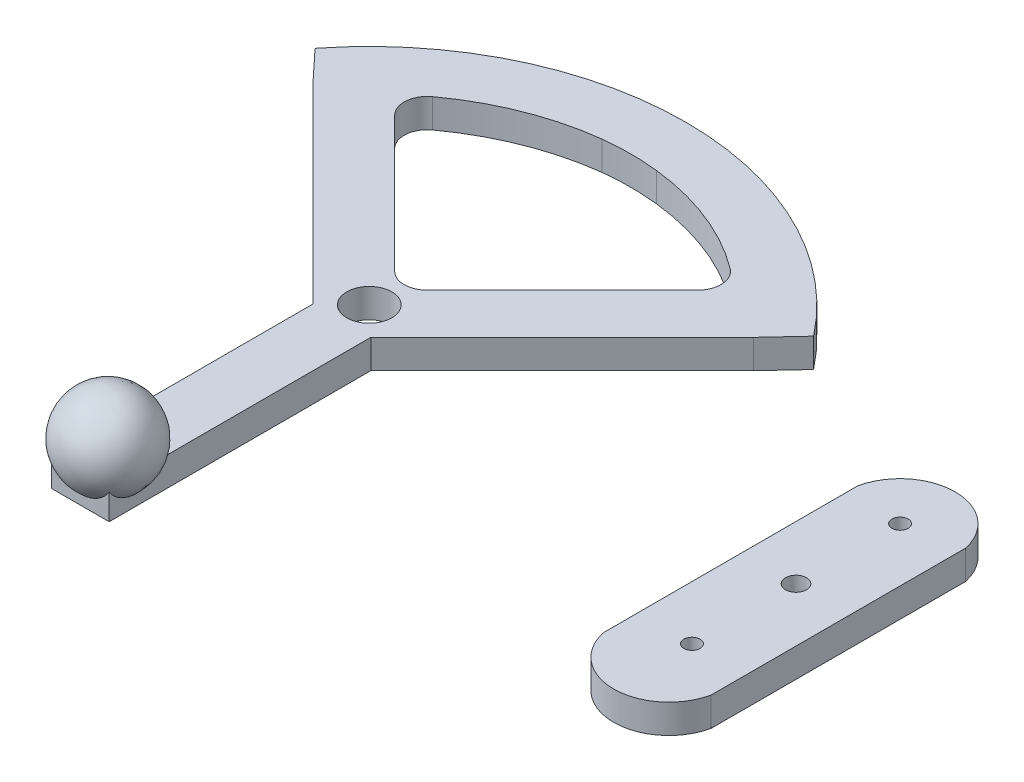
ISO-10303-21;
HEADER;
FILE_DESCRIPTION(('STEP AP214'),'2;1');
FILE_NAME('part.step','',(''),(''),'','','');
FILE_SCHEMA(('AUTOMOTIVE_DESIGN { 1 0 10303 214 1 1 1 1 }'));
ENDSEC;
DATA;
#1=APPLICATION_CONTEXT('core data for automotive mechanical design processes');
#2=APPLICATION_PROTOCOL_DEFINITION('international standard','automotive_design',2000,#1);
#3=PRODUCT_CONTEXT('',#1,'mechanical');
#4=PRODUCT('Part','Part','',(#3));
#5=PRODUCT_RELATED_PRODUCT_CATEGORY('part','',(#4));
#6=PRODUCT_DEFINITION_FORMATION('','',#4);
#7=PRODUCT_DEFINITION_CONTEXT('part definition',#1,'design');
#8=PRODUCT_DEFINITION('design','',#6,#7);
#9=PRODUCT_DEFINITION_SHAPE('','',#8);
#10=(LENGTH_UNIT() NAMED_UNIT(*) SI_UNIT(.MILLI.,.METRE.));
#11=(NAMED_UNIT(*) PLANE_ANGLE_UNIT() SI_UNIT($,.RADIAN.));
#12=(NAMED_UNIT(*) SI_UNIT($,.STERADIAN.) SOLID_ANGLE_UNIT());
#13=UNCERTAINTY_MEASURE_WITH_UNIT(LENGTH_MEASURE(1.E-05),#10,'distance_accuracy_value','');
#14=(GEOMETRIC_REPRESENTATION_CONTEXT(3) GLOBAL_UNCERTAINTY_ASSIGNED_CONTEXT((#13)) GLOBAL_UNIT_ASSIGNED_CONTEXT((#10,
#11,#12)) REPRESENTATION_CONTEXT('',''));
#15=CARTESIAN_POINT('',(0.,0.,0.));
#16=DIRECTION('',(0.,0.,1.));
#17=DIRECTION('',(1.,0.,0.));
#18=AXIS2_PLACEMENT_3D('',#15,#16,#17);
#19=CARTESIAN_POINT('',(99.9381169188753,12.6954113524003,34.1249884138105));
#20=DIRECTION('',(0.,-1.,0.));
#21=DIRECTION('',(0.,0.,1.));
#22=AXIS2_PLACEMENT_3D('',#19,#20,#21);
#23=PLANE('',#22);
#24=CARTESIAN_POINT('',(99.9381169188752,12.6954113524003,-16.6750115861895));
#25=DIRECTION('',(0.,1.,0.));
#26=DIRECTION('',(0.,0.,-1.));
#27=AXIS2_PLACEMENT_3D('',#24,#25,#26);
#28=CIRCLE('',#27,1.77800000000001);
#29=CARTESIAN_POINT('',(99.9381169188752,12.6954113524003,-18.4530115861895));
#30=VERTEX_POINT('',#29);
#31=EDGE_CURVE('E151',#30,#30,#28,.T.);
#32=ORIENTED_EDGE('',*,*,#31,.F.);
#33=EDGE_LOOP('',(#32));
#34=FACE_BOUND('',#33,.T.);
#35=DIRECTION('',(0.,0.,-1.));
#36=VECTOR('',#35,1.);
#37=CARTESIAN_POINT('',(111.787378232907,12.6954113524002,31.5849884138105));
#38=LINE('',#37,#36);
#39=CARTESIAN_POINT('',(111.787378232907,12.6954113524002,36.6649884138105));
#40=VERTEX_POINT('',#39);
#41=CARTESIAN_POINT('',(111.787378232906,12.6954113524002,-19.2150115861895));
#42=VERTEX_POINT('',#41);
#43=EDGE_CURVE('E102',#40,#42,#38,.T.);
#44=ORIENTED_EDGE('',*,*,#43,.T.);
#45=CARTESIAN_POINT('',(99.9381169188752,12.6954113524003,-16.6750115861895));
#46=DIRECTION('',(0.,1.,0.));
#47=DIRECTION('',(0.,0.,-1.));
#48=AXIS2_PLACEMENT_3D('',#45,#46,#47);
#49=CIRCLE('',#48,12.1184402333054);
#50=CARTESIAN_POINT('',(88.088855604844,12.6954113524005,-19.2150115861894));
#51=VERTEX_POINT('',#50);
#52=EDGE_CURVE('E105',#42,#51,#49,.T.);
#53=ORIENTED_EDGE('',*,*,#52,.T.);
#54=DIRECTION('',(0.,0.,1.));
#55=VECTOR('',#54,1.);
#56=CARTESIAN_POINT('',(88.0888556048439,12.6954113524005,-19.2150115861894));
#57=LINE('',#56,#55);
#58=CARTESIAN_POINT('',(88.0888556048442,12.6954113524005,36.6649884138106));
#59=VERTEX_POINT('',#58);
#60=EDGE_CURVE('E109',#51,#59,#57,.T.);
#61=ORIENTED_EDGE('',*,*,#60,.T.);
#62=CARTESIAN_POINT('',(99.9381169188753,12.6954113524003,34.1249884138105));
#63=DIRECTION('',(0.,1.,0.));
#64=DIRECTION('',(0.,0.,1.));
#65=AXIS2_PLACEMENT_3D('',#62,#63,#64);
#66=CIRCLE('',#65,12.1184402333055);
#67=EDGE_CURVE('E74',#59,#40,#66,.T.);
#68=ORIENTED_EDGE('',*,*,#67,.T.);
#69=EDGE_LOOP('',(#44,#53,#61,#68));
#70=FACE_BOUND('',#69,.T.);
#71=CARTESIAN_POINT('',(99.9381169188753,12.6954113524003,6.18498841381052));
#72=DIRECTION('',(0.,1.,0.));
#73=DIRECTION('',(0.,0.,-1.));
#74=AXIS2_PLACEMENT_3D('',#71,#72,#73);
#75=CIRCLE('',#74,2.305);
#76=CARTESIAN_POINT('',(99.9381169188752,12.6954113524003,3.87998841381051));
#77=VERTEX_POINT('',#76);
#78=EDGE_CURVE('E123',#77,#77,#75,.T.);
#79=ORIENTED_EDGE('',*,*,#78,.F.);
#80=EDGE_LOOP('',(#79));
#81=FACE_BOUND('',#80,.T.);
#82=CARTESIAN_POINT('',(99.9381169188753,12.6954113524003,29.0449884138106));
#83=DIRECTION('',(0.,1.,0.));
#84=DIRECTION('',(0.,0.,-1.));
#85=AXIS2_PLACEMENT_3D('',#82,#83,#84);
#86=CIRCLE('',#85,1.778);
#87=CARTESIAN_POINT('',(99.9381169188753,12.6954113524003,27.2669884138105));
#88=VERTEX_POINT('',#87);
#89=EDGE_CURVE('E145',#88,#88,#86,.T.);
#90=ORIENTED_EDGE('',*,*,#89,.F.);
#91=EDGE_LOOP('',(#90));
#92=FACE_BOUND('',#91,.T.);
#93=ADVANCED_FACE('F57',(#34,#70,#81,#92),#23,.F.);
#94=CARTESIAN_POINT('',(99.9381169188753,6.34541135240033,34.1249884138105));
#95=DIRECTION('',(0.,-1.,0.));
#96=DIRECTION('',(0.,0.,1.));
#97=AXIS2_PLACEMENT_3D('',#94,#95,#96);
#98=PLANE('',#97);
#99=CARTESIAN_POINT('',(99.9381169188751,6.34541135240033,-16.6750115861895));
#100=DIRECTION('',(0.,1.,0.));
#101=DIRECTION('',(0.,0.,-1.));
#102=AXIS2_PLACEMENT_3D('',#99,#100,#101);
#103=CIRCLE('',#102,1.77800000000001);
#104=CARTESIAN_POINT('',(99.9381169188751,6.34541135240033,-18.4530115861895));
#105=VERTEX_POINT('',#104);
#106=EDGE_CURVE('E148',#105,#105,#103,.T.);
#107=ORIENTED_EDGE('',*,*,#106,.T.);
#108=EDGE_LOOP('',(#107));
#109=FACE_BOUND('',#108,.T.);
#110=DIRECTION('',(0.,0.,-1.));
#111=VECTOR('',#110,1.);
#112=CARTESIAN_POINT('',(111.787378232906,6.34541135240021,31.5849884138105));
#113=LINE('',#112,#111);
#114=CARTESIAN_POINT('',(111.787378232906,6.34541135240021,36.6649884138105));
#115=VERTEX_POINT('',#114);
#116=CARTESIAN_POINT('',(111.787378232906,6.34541135240021,-19.2150115861895));
#117=VERTEX_POINT('',#116);
#118=EDGE_CURVE('E97',#115,#117,#113,.T.);
#119=ORIENTED_EDGE('',*,*,#118,.F.);
#120=CARTESIAN_POINT('',(99.9381169188753,6.34541135240033,34.1249884138105));
#121=DIRECTION('',(0.,1.,0.));
#122=DIRECTION('',(0.,0.,1.));
#123=AXIS2_PLACEMENT_3D('',#120,#121,#122);
#124=CIRCLE('',#123,12.1184402333055);
#125=CARTESIAN_POINT('',(88.0888556048441,6.34541135240045,36.6649884138106));
#126=VERTEX_POINT('',#125);
#127=EDGE_CURVE('E126',#126,#115,#124,.T.);
#128=ORIENTED_EDGE('',*,*,#127,.F.);
#129=DIRECTION('',(0.,0.,1.));
#130=VECTOR('',#129,1.);
#131=CARTESIAN_POINT('',(88.0888556048441,6.34541135240045,31.5849884138106));
#132=LINE('',#131,#130);
#133=CARTESIAN_POINT('',(88.0888556048439,6.34541135240045,-19.2150115861894));
#134=VERTEX_POINT('',#133);
#135=EDGE_CURVE('E90',#134,#126,#132,.T.);
#136=ORIENTED_EDGE('',*,*,#135,.F.);
#137=CARTESIAN_POINT('',(99.9381169188751,6.34541135240033,-16.6750115861895));
#138=DIRECTION('',(0.,1.,0.));
#139=DIRECTION('',(0.,0.,-1.));
#140=AXIS2_PLACEMENT_3D('',#137,#138,#139);
#141=CIRCLE('',#140,12.1184402333054);
#142=EDGE_CURVE('E114',#117,#134,#141,.T.);
#143=ORIENTED_EDGE('',*,*,#142,.F.);
#144=EDGE_LOOP('',(#119,#128,#136,#143));
#145=FACE_BOUND('',#144,.T.);
#146=CARTESIAN_POINT('',(99.9381169188752,6.34541135240033,6.18498841381052));
#147=DIRECTION('',(0.,1.,0.));
#148=DIRECTION('',(0.,0.,-1.));
#149=AXIS2_PLACEMENT_3D('',#146,#147,#148);
#150=CIRCLE('',#149,2.305);
#151=CARTESIAN_POINT('',(99.9381169188752,6.34541135240033,3.87998841381051));
#152=VERTEX_POINT('',#151);
#153=EDGE_CURVE('E140',#152,#152,#150,.T.);
#154=ORIENTED_EDGE('',*,*,#153,.T.);
#155=EDGE_LOOP('',(#154));
#156=FACE_BOUND('',#155,.T.);
#157=CARTESIAN_POINT('',(99.9381169188753,6.34541135240033,29.0449884138106));
#158=DIRECTION('',(0.,1.,0.));
#159=DIRECTION('',(0.,0.,-1.));
#160=AXIS2_PLACEMENT_3D('',#157,#158,#159);
#161=CIRCLE('',#160,1.778);
#162=CARTESIAN_POINT('',(99.9381169188753,6.34541135240033,27.2669884138105));
#163=VERTEX_POINT('',#162);
#164=EDGE_CURVE('E143',#163,#163,#161,.T.);
#165=ORIENTED_EDGE('',*,*,#164,.T.);
#166=EDGE_LOOP('',(#165));
#167=FACE_BOUND('',#166,.T.);
#168=ADVANCED_FACE('F132',(#109,#145,#156,#167),#98,.T.);
#169=CARTESIAN_POINT('',(111.787378232907,12.6954113524002,31.5849884138105));
#170=DIRECTION('',(-1.,0.,0.));
#171=DIRECTION('',(0.,0.,1.));
#172=AXIS2_PLACEMENT_3D('',#169,#170,#171);
#173=PLANE('',#172);
#174=ORIENTED_EDGE('',*,*,#118,.T.);
#175=DIRECTION('',(0.,-1.,0.));
#176=VECTOR('',#175,1.);
#177=CARTESIAN_POINT('',(111.787378232906,12.6954113524002,-19.2150115861895));
#178=LINE('',#177,#176);
#179=EDGE_CURVE('E13',#42,#117,#178,.T.);
#180=ORIENTED_EDGE('',*,*,#179,.F.);
#181=ORIENTED_EDGE('',*,*,#43,.F.);
#182=DIRECTION('',(0.,-1.,0.));
#183=VECTOR('',#182,1.);
#184=CARTESIAN_POINT('',(111.787378232907,12.6954113524002,36.6649884138105));
#185=LINE('',#184,#183);
#186=EDGE_CURVE('E118',#40,#115,#185,.T.);
#187=ORIENTED_EDGE('',*,*,#186,.T.);
#188=EDGE_LOOP('',(#174,#180,#181,#187));
#189=FACE_BOUND('',#188,.T.);
#190=ADVANCED_FACE('F59',(#189),#173,.F.);
#191=CARTESIAN_POINT('',(99.9381169188752,12.6954113524003,-16.6750115861895));
#192=DIRECTION('',(0.,-1.,0.));
#193=DIRECTION('',(0.,0.,1.));
#194=AXIS2_PLACEMENT_3D('',#191,#192,#193);
#195=CYLINDRICAL_SURFACE('',#194,12.1184402333054);
#196=ORIENTED_EDGE('',*,*,#142,.T.);
#197=DIRECTION('',(0.,-1.,0.));
#198=VECTOR('',#197,1.);
#199=CARTESIAN_POINT('',(88.088855604844,12.6954113524005,-19.2150115861894));
#200=LINE('',#199,#198);
#201=EDGE_CURVE('E66',#51,#134,#200,.T.);
#202=ORIENTED_EDGE('',*,*,#201,.F.);
#203=ORIENTED_EDGE('',*,*,#52,.F.);
#204=ORIENTED_EDGE('',*,*,#179,.T.);
#205=EDGE_LOOP('',(#196,#202,#203,#204));
#206=FACE_BOUND('',#205,.T.);
#207=ADVANCED_FACE('F113',(#206),#195,.T.);
#208=CARTESIAN_POINT('',(88.0888556048442,12.6954113524005,31.5849884138106));
#209=DIRECTION('',(1.,0.,0.));
#210=DIRECTION('',(0.,0.,-1.));
#211=AXIS2_PLACEMENT_3D('',#208,#209,#210);
#212=PLANE('',#211);
#213=ORIENTED_EDGE('',*,*,#135,.T.);
#214=DIRECTION('',(0.,-1.,0.));
#215=VECTOR('',#214,1.);
#216=CARTESIAN_POINT('',(88.0888556048442,12.6954113524005,36.6649884138106));
#217=LINE('',#216,#215);
#218=EDGE_CURVE('E115',#59,#126,#217,.T.);
#219=ORIENTED_EDGE('',*,*,#218,.F.);
#220=ORIENTED_EDGE('',*,*,#60,.F.);
#221=ORIENTED_EDGE('',*,*,#201,.T.);
#222=EDGE_LOOP('',(#213,#219,#220,#221));
#223=FACE_BOUND('',#222,.T.);
#224=ADVANCED_FACE('F116',(#223),#212,.F.);
#225=CARTESIAN_POINT('',(99.9381169188753,12.6954113524003,34.1249884138105));
#226=DIRECTION('',(0.,-1.,0.));
#227=DIRECTION('',(0.,0.,1.));
#228=AXIS2_PLACEMENT_3D('',#225,#226,#227);
#229=CYLINDRICAL_SURFACE('',#228,12.1184402333055);
#230=ORIENTED_EDGE('',*,*,#127,.T.);
#231=ORIENTED_EDGE('',*,*,#186,.F.);
#232=ORIENTED_EDGE('',*,*,#67,.F.);
#233=ORIENTED_EDGE('',*,*,#218,.T.);
#234=EDGE_LOOP('',(#230,#231,#232,#233));
#235=FACE_BOUND('',#234,.T.);
#236=ADVANCED_FACE('F131',(#235),#229,.T.);
#237=CARTESIAN_POINT('',(99.9381169188753,12.6954113524003,6.18498841381052));
#238=DIRECTION('',(0.,-1.,0.));
#239=DIRECTION('',(0.,0.,1.));
#240=AXIS2_PLACEMENT_3D('',#237,#238,#239);
#241=CYLINDRICAL_SURFACE('',#240,2.305);
#242=ORIENTED_EDGE('',*,*,#78,.T.);
#243=EDGE_LOOP('',(#242));
#244=FACE_BOUND('',#243,.T.);
#245=ORIENTED_EDGE('',*,*,#153,.F.);
#246=EDGE_LOOP('',(#245));
#247=FACE_BOUND('',#246,.T.);
#248=ADVANCED_FACE('F160',(#244,#247),#241,.F.);
#249=CARTESIAN_POINT('',(99.9381169188752,12.6954113524003,-16.6750115861895));
#250=DIRECTION('',(0.,-1.,0.));
#251=DIRECTION('',(0.,0.,1.));
#252=AXIS2_PLACEMENT_3D('',#249,#250,#251);
#253=CYLINDRICAL_SURFACE('',#252,1.77800000000001);
#254=ORIENTED_EDGE('',*,*,#31,.T.);
#255=EDGE_LOOP('',(#254));
#256=FACE_BOUND('',#255,.T.);
#257=ORIENTED_EDGE('',*,*,#106,.F.);
#258=EDGE_LOOP('',(#257));
#259=FACE_BOUND('',#258,.T.);
#260=ADVANCED_FACE('F170',(#256,#259),#253,.F.);
#261=CARTESIAN_POINT('',(99.9381169188753,12.6954113524003,29.0449884138106));
#262=DIRECTION('',(0.,-1.,0.));
#263=DIRECTION('',(0.,0.,1.));
#264=AXIS2_PLACEMENT_3D('',#261,#262,#263);
#265=CYLINDRICAL_SURFACE('',#264,1.778);
#266=ORIENTED_EDGE('',*,*,#89,.T.);
#267=EDGE_LOOP('',(#266));
#268=FACE_BOUND('',#267,.T.);
#269=ORIENTED_EDGE('',*,*,#164,.F.);
#270=EDGE_LOOP('',(#269));
#271=FACE_BOUND('',#270,.T.);
#272=ADVANCED_FACE('F168',(#268,#271),#265,.F.);
#273=CLOSED_SHELL('',(#93,#168,#190,#207,#224,#236,#248,#260,#272));
#274=MANIFOLD_SOLID_BREP('B2',#273);
#275=CARTESIAN_POINT('',(-39.7785373265375,12.7,-45.3516658256481));
#276=DIRECTION('',(0.707106781186548,0.,-0.707106781186547));
#277=DIRECTION('',(-0.707106781186547,0.,-0.707106781186548));
#278=AXIS2_PLACEMENT_3D('',#275,#276,#277);
#279=PLANE('',#278);
#280=DIRECTION('',(0.707106781186547,0.,0.707106781186548));
#281=VECTOR('',#280,1.);
#282=CARTESIAN_POINT('',(-39.7785373265375,6.35,-45.3516658256481));
#283=LINE('',#282,#281);
#284=CARTESIAN_POINT('',(-33.2831311678834,6.35,-38.856259666994));
#285=VERTEX_POINT('',#284);
#286=CARTESIAN_POINT('',(-3.59210244842767,6.35,-9.16523094753825));
#287=VERTEX_POINT('',#286);
#288=EDGE_CURVE('E274',#285,#287,#283,.T.);
#289=ORIENTED_EDGE('',*,*,#288,.F.);
#290=DIRECTION('',(0.,-1.,0.));
#291=VECTOR('',#290,1.);
#292=CARTESIAN_POINT('',(-33.2831311678833,90.455148343755,-38.8562596669941));
#293=LINE('',#292,#291);
#294=CARTESIAN_POINT('',(-33.2831311678834,12.7,-38.856259666994));
#295=VERTEX_POINT('',#294);
#296=EDGE_CURVE('E269',#295,#285,#293,.T.);
#297=ORIENTED_EDGE('',*,*,#296,.F.);
#298=DIRECTION('',(0.707106781186547,0.,0.707106781186548));
#299=VECTOR('',#298,1.);
#300=CARTESIAN_POINT('',(-39.7785373265375,12.7,-45.3516658256481));
#301=LINE('',#300,#299);
#302=CARTESIAN_POINT('',(-3.59210244842767,12.7,-9.16523094753825));
#303=VERTEX_POINT('',#302);
#304=EDGE_CURVE('E474',#295,#303,#301,.T.);
#305=ORIENTED_EDGE('',*,*,#304,.T.);
#306=DIRECTION('',(0.,-1.,0.));
#307=VECTOR('',#306,1.);
#308=CARTESIAN_POINT('',(-3.59210244842766,0.,-9.16523094753824));
#309=LINE('',#308,#307);
#310=EDGE_CURVE('E887',#303,#287,#309,.T.);
#311=ORIENTED_EDGE('',*,*,#310,.T.);
#312=EDGE_LOOP('',(#289,#297,#305,#311));
#313=FACE_BOUND('',#312,.T.);
#314=ADVANCED_FACE('F254',(#313),#279,.T.);
#315=CARTESIAN_POINT('',(0.,12.7,0.));
#316=DIRECTION('',(0.,1.,0.));
#317=DIRECTION('',(0.,0.,1.));
#318=AXIS2_PLACEMENT_3D('',#315,#316,#317);
#319=PLANE('',#318);
#320=ORIENTED_EDGE('',*,*,#304,.F.);
#321=CARTESIAN_POINT('',(-29.6910287194557,12.7,-42.4483621154218));
#322=DIRECTION('',(0.,1.,0.));
#323=DIRECTION('',(0.,0.,1.));
#324=AXIS2_PLACEMENT_3D('',#321,#322,#323);
#325=CIRCLE('',#324,5.08);
#326=CARTESIAN_POINT('',(-32.692631835589,12.7,-46.5467494486565));
#327=VERTEX_POINT('',#326);
#328=EDGE_CURVE('E394',#327,#295,#325,.T.);
#329=ORIENTED_EDGE('',*,*,#328,.F.);
#330=CARTESIAN_POINT('',(0.887803026152101,12.7,-0.696041158092707));
#331=DIRECTION('',(0.,1.,0.));
#332=DIRECTION('',(0.,0.,1.));
#333=AXIS2_PLACEMENT_3D('',#330,#331,#332);
#334=CIRCLE('',#333,56.8325000000001);
#335=CARTESIAN_POINT('',(-5.94025595338294,12.7,-57.1168765544425));
#336=VERTEX_POINT('',#335);
#337=EDGE_CURVE('E381',#327,#336,#334,.F.);
#338=ORIENTED_EDGE('',*,*,#337,.T.);
#339=CARTESIAN_POINT('',(0.,12.7,-5.57312849911058));
#340=DIRECTION('',(0.,1.,0.));
#341=DIRECTION('',(0.,0.,1.));
#342=AXIS2_PLACEMENT_3D('',#339,#340,#341);
#343=CIRCLE('',#342,51.8849169256658);
#344=CARTESIAN_POINT('',(5.95896544452985,12.7,-57.1147169031764));
#345=VERTEX_POINT('',#344);
#346=EDGE_CURVE('E403',#336,#345,#343,.F.);
#347=ORIENTED_EDGE('',*,*,#346,.T.);
#348=CARTESIAN_POINT('',(0.,12.7,-2.81200490658602));
#349=DIRECTION('',(0.,1.,0.));
#350=DIRECTION('',(0.,0.,1.));
#351=AXIS2_PLACEMENT_3D('',#348,#349,#350);
#352=CIRCLE('',#351,54.6286902584507);
#353=CARTESIAN_POINT('',(32.7547865262767,12.7,-46.5317688466142));
#354=VERTEX_POINT('',#353);
#355=EDGE_CURVE('E398',#345,#354,#352,.F.);
#356=ORIENTED_EDGE('',*,*,#355,.T.);
#357=CARTESIAN_POINT('',(29.708872103539,12.7,-42.4662054995049));
#358=DIRECTION('',(0.,1.,0.));
#359=DIRECTION('',(0.,0.,1.));
#360=AXIS2_PLACEMENT_3D('',#357,#358,#359);
#361=CIRCLE('',#360,5.07999999999999);
#362=CARTESIAN_POINT('',(33.3009745519667,12.7,-38.8741030510773));
#363=VERTEX_POINT('',#362);
#364=EDGE_CURVE('E410',#363,#354,#361,.T.);
#365=ORIENTED_EDGE('',*,*,#364,.F.);
#366=DIRECTION('',(0.707106781186548,0.,-0.707106781186547));
#367=VECTOR('',#366,1.);
#368=CARTESIAN_POINT('',(0.,12.7,-5.57312849911058));
#369=LINE('',#368,#367);
#370=CARTESIAN_POINT('',(3.59210244842766,12.7,-9.16523094753824));
#371=VERTEX_POINT('',#370);
#372=EDGE_CURVE('E476',#371,#363,#369,.T.);
#373=ORIENTED_EDGE('',*,*,#372,.F.);
#374=CARTESIAN_POINT('',(0.,12.7,-12.7573333959659));
#375=DIRECTION('',(0.,1.,0.));
#376=DIRECTION('',(0.,0.,1.));
#377=AXIS2_PLACEMENT_3D('',#374,#375,#376);
#378=CIRCLE('',#377,5.08);
#379=EDGE_CURVE('E262',#371,#303,#378,.F.);
#380=ORIENTED_EDGE('',*,*,#379,.T.);
#381=EDGE_LOOP('',(#320,#329,#338,#347,#356,#365,#373,#380));
#382=FACE_BOUND('',#381,.T.);
#383=CARTESIAN_POINT('',(0.,12.7,0.));
#384=DIRECTION('',(0.,1.,0.));
#385=DIRECTION('',(0.,0.,1.));
#386=AXIS2_PLACEMENT_3D('',#383,#384,#385);
#387=CIRCLE('',#386,4.953);
#388=CARTESIAN_POINT('',(0.,12.7,4.953));
#389=VERTEX_POINT('',#388);
#390=EDGE_CURVE('E471',#389,#389,#387,.T.);
#391=ORIENTED_EDGE('',*,*,#390,.F.);
#392=EDGE_LOOP('',(#391));
#393=FACE_BOUND('',#392,.T.);
#394=DIRECTION('',(0.681998360062498,0.,-0.731353701619171));
#395=VECTOR('',#394,1.);
#396=CARTESIAN_POINT('',(49.4171515154173,12.7,-37.1184070236845));
#397=LINE('',#396,#395);
#398=CARTESIAN_POINT('',(48.391694320571,12.7,-36.0187388144617));
#399=VERTEX_POINT('',#398);
#400=CARTESIAN_POINT('',(54.7608316819994,12.7,-42.8488024307067));
#401=VERTEX_POINT('',#400);
#402=EDGE_CURVE('E493',#399,#401,#397,.T.);
#403=ORIENTED_EDGE('',*,*,#402,.T.);
#404=CARTESIAN_POINT('',(0.,12.7,0.));
#405=DIRECTION('',(0.,1.,0.));
#406=DIRECTION('',(0.,0.,1.));
#407=AXIS2_PLACEMENT_3D('',#404,#405,#406);
#408=CIRCLE('',#407,69.5325);
#409=CARTESIAN_POINT('',(-54.7608316819994,12.7,-42.8488024307067));
#410=VERTEX_POINT('',#409);
#411=EDGE_CURVE('E428',#401,#410,#408,.T.);
#412=ORIENTED_EDGE('',*,*,#411,.T.);
#413=DIRECTION('',(0.681998360062498,0.,0.731353701619171));
#414=VECTOR('',#413,1.);
#415=CARTESIAN_POINT('',(-56.4189854668726,12.7,-44.6269546660137));
#416=LINE('',#415,#414);
#417=CARTESIAN_POINT('',(-48.391694320571,12.7,-36.0187388144618));
#418=VERTEX_POINT('',#417);
#419=EDGE_CURVE('E494',#410,#418,#416,.T.);
#420=ORIENTED_EDGE('',*,*,#419,.T.);
#421=DIRECTION('',(-0.707106781186547,0.,-0.707106781186548));
#422=VECTOR('',#421,1.);
#423=CARTESIAN_POINT('',(-48.391694320571,12.7,-36.0187388144618));
#424=LINE('',#423,#422);
#425=CARTESIAN_POINT('',(-6.34999999999972,12.7,6.02295550610956));
#426=VERTEX_POINT('',#425);
#427=EDGE_CURVE('E481',#426,#418,#424,.T.);
#428=ORIENTED_EDGE('',*,*,#427,.F.);
#429=DIRECTION('',(0.,0.,-1.));
#430=VECTOR('',#429,1.);
#431=CARTESIAN_POINT('',(-6.34999999999971,12.7,4.87647737193525));
#432=LINE('',#431,#430);
#433=CARTESIAN_POINT('',(-6.34999999999971,12.7,50.9544231423557));
#434=VERTEX_POINT('',#433);
#435=EDGE_CURVE('E487',#434,#426,#432,.T.);
#436=ORIENTED_EDGE('',*,*,#435,.F.);
#437=CARTESIAN_POINT('',(0.,12.7,57.4301779246189));
#438=DIRECTION('',(0.,1.,0.));
#439=DIRECTION('',(0.,0.,1.));
#440=AXIS2_PLACEMENT_3D('',#437,#438,#439);
#441=CIRCLE('',#440,9.06961410424942);
#442=CARTESIAN_POINT('',(6.35000000000029,12.7,50.9544231423563));
#443=VERTEX_POINT('',#442);
#444=EDGE_CURVE('E438',#443,#434,#441,.T.);
#445=ORIENTED_EDGE('',*,*,#444,.F.);
#446=DIRECTION('',(0.,0.,1.));
#447=VECTOR('',#446,1.);
#448=CARTESIAN_POINT('',(6.35000000000029,12.7,4.87647737193525));
#449=LINE('',#448,#447);
#450=CARTESIAN_POINT('',(6.35000000000029,12.7,6.022955506109));
#451=VERTEX_POINT('',#450);
#452=EDGE_CURVE('E490',#451,#443,#449,.T.);
#453=ORIENTED_EDGE('',*,*,#452,.F.);
#454=DIRECTION('',(-0.707106781186548,0.,0.707106781186547));
#455=VECTOR('',#454,1.);
#456=CARTESIAN_POINT('',(0.,12.7,12.3729555061093));
#457=LINE('',#456,#455);
#458=EDGE_CURVE('E478',#399,#451,#457,.T.);
#459=ORIENTED_EDGE('',*,*,#458,.F.);
#460=EDGE_LOOP('',(#403,#412,#420,#428,#436,#445,#453,#459));
#461=FACE_BOUND('',#460,.T.);
#462=ADVANCED_FACE('F895',(#382,#393,#461),#319,.T.);
#463=CARTESIAN_POINT('',(48.391694320571,0.,-36.0187388144617));
#464=DIRECTION('',(0.731353701619171,0.,0.681998360062498));
#465=DIRECTION('',(0.681998360062498,0.,-0.731353701619171));
#466=AXIS2_PLACEMENT_3D('',#463,#464,#465);
#467=PLANE('',#466);
#468=DIRECTION('',(-0.681998360062498,0.,0.731353701619171));
#469=VECTOR('',#468,1.);
#470=CARTESIAN_POINT('',(48.391694320571,6.35,-36.0187388144617));
#471=LINE('',#470,#469);
#472=CARTESIAN_POINT('',(54.7608316819994,6.35,-42.8488024307067));
#473=VERTEX_POINT('',#472);
#474=CARTESIAN_POINT('',(48.391694320571,6.35,-36.0187388144617));
#475=VERTEX_POINT('',#474);
#476=EDGE_CURVE('E454',#473,#475,#471,.T.);
#477=ORIENTED_EDGE('',*,*,#476,.F.);
#478=DIRECTION('',(0.,-1.,0.));
#479=VECTOR('',#478,1.);
#480=CARTESIAN_POINT('',(54.7608316819994,25.654,-42.8488024307067));
#481=LINE('',#480,#479);
#482=EDGE_CURVE('E426',#401,#473,#481,.T.);
#483=ORIENTED_EDGE('',*,*,#482,.F.);
#484=ORIENTED_EDGE('',*,*,#402,.F.);
#485=DIRECTION('',(0.,1.,0.));
#486=VECTOR('',#485,1.);
#487=CARTESIAN_POINT('',(48.391694320571,0.,-36.0187388144617));
#488=LINE('',#487,#486);
#489=EDGE_CURVE('E498',#475,#399,#488,.T.);
#490=ORIENTED_EDGE('',*,*,#489,.F.);
#491=EDGE_LOOP('',(#477,#483,#484,#490));
#492=FACE_BOUND('',#491,.T.);
#493=ADVANCED_FACE('F905',(#492),#467,.T.);
#494=CARTESIAN_POINT('',(-57.1706898676213,0.,-45.4330589445645));
#495=DIRECTION('',(-0.731353701619171,0.,0.681998360062498));
#496=DIRECTION('',(0.681998360062498,0.,0.731353701619171));
#497=AXIS2_PLACEMENT_3D('',#494,#495,#496);
#498=PLANE('',#497);
#499=ORIENTED_EDGE('',*,*,#419,.F.);
#500=DIRECTION('',(0.,-1.,0.));
#501=VECTOR('',#500,1.);
#502=CARTESIAN_POINT('',(-54.7608316819994,25.654,-42.8488024307067));
#503=LINE('',#502,#501);
#504=CARTESIAN_POINT('',(-54.7608316819994,6.35,-42.8488024307067));
#505=VERTEX_POINT('',#504);
#506=EDGE_CURVE('E425',#410,#505,#503,.T.);
#507=ORIENTED_EDGE('',*,*,#506,.T.);
#508=DIRECTION('',(-0.681998360062498,0.,-0.731353701619171));
#509=VECTOR('',#508,1.);
#510=CARTESIAN_POINT('',(-57.1706898676213,6.35,-45.4330589445645));
#511=LINE('',#510,#509);
#512=CARTESIAN_POINT('',(-48.391694320571,6.35,-36.0187388144618));
#513=VERTEX_POINT('',#512);
#514=EDGE_CURVE('E468',#513,#505,#511,.T.);
#515=ORIENTED_EDGE('',*,*,#514,.F.);
#516=DIRECTION('',(0.,1.,0.));
#517=VECTOR('',#516,1.);
#518=CARTESIAN_POINT('',(-48.391694320571,0.,-36.0187388144618));
#519=LINE('',#518,#517);
#520=EDGE_CURVE('E609',#513,#418,#519,.T.);
#521=ORIENTED_EDGE('',*,*,#520,.T.);
#522=EDGE_LOOP('',(#499,#507,#515,#521));
#523=FACE_BOUND('',#522,.T.);
#524=ADVANCED_FACE('F925',(#523),#498,.T.);
#525=CARTESIAN_POINT('',(0.,6.35,0.));
#526=DIRECTION('',(0.,1.,0.));
#527=DIRECTION('',(0.,0.,1.));
#528=AXIS2_PLACEMENT_3D('',#525,#526,#527);
#529=PLANE('',#528);
#530=CARTESIAN_POINT('',(-29.6910287194557,6.35,-42.4483621154218));
#531=DIRECTION('',(0.,1.,0.));
#532=DIRECTION('',(0.,0.,1.));
#533=AXIS2_PLACEMENT_3D('',#530,#531,#532);
#534=CIRCLE('',#533,5.08);
#535=CARTESIAN_POINT('',(-32.692631835589,6.35,-46.5467494486565));
#536=VERTEX_POINT('',#535);
#537=EDGE_CURVE('E391',#536,#285,#534,.T.);
#538=ORIENTED_EDGE('',*,*,#537,.T.);
#539=ORIENTED_EDGE('',*,*,#288,.T.);
#540=CARTESIAN_POINT('',(0.,6.35,-12.7573333959659));
#541=DIRECTION('',(0.,1.,0.));
#542=DIRECTION('',(0.,0.,1.));
#543=AXIS2_PLACEMENT_3D('',#540,#541,#542);
#544=CIRCLE('',#543,5.08);
#545=CARTESIAN_POINT('',(3.59210244842766,6.35,-9.16523094753823));
#546=VERTEX_POINT('',#545);
#547=EDGE_CURVE('E442',#546,#287,#544,.F.);
#548=ORIENTED_EDGE('',*,*,#547,.F.);
#549=DIRECTION('',(0.707106781186548,0.,-0.707106781186547));
#550=VECTOR('',#549,1.);
#551=CARTESIAN_POINT('',(0.,6.35,-5.57312849911058));
#552=LINE('',#551,#550);
#553=CARTESIAN_POINT('',(33.3009745519667,6.35,-38.8741030510773));
#554=VERTEX_POINT('',#553);
#555=EDGE_CURVE('E445',#546,#554,#552,.T.);
#556=ORIENTED_EDGE('',*,*,#555,.T.);
#557=CARTESIAN_POINT('',(29.708872103539,6.35,-42.4662054995049));
#558=DIRECTION('',(0.,1.,0.));
#559=DIRECTION('',(0.,0.,1.));
#560=AXIS2_PLACEMENT_3D('',#557,#558,#559);
#561=CIRCLE('',#560,5.07999999999999);
#562=CARTESIAN_POINT('',(32.7547865262767,6.35,-46.5317688466142));
#563=VERTEX_POINT('',#562);
#564=EDGE_CURVE('E397',#554,#563,#561,.T.);
#565=ORIENTED_EDGE('',*,*,#564,.T.);
#566=CARTESIAN_POINT('',(0.,6.35,-2.81200490658602));
#567=DIRECTION('',(0.,-1.,0.));
#568=DIRECTION('',(0.,0.,-1.));
#569=AXIS2_PLACEMENT_3D('',#566,#567,#568);
#570=CIRCLE('',#569,54.6286902584507);
#571=CARTESIAN_POINT('',(5.95896544452985,6.35,-57.1147169031765));
#572=VERTEX_POINT('',#571);
#573=EDGE_CURVE('E416',#572,#563,#570,.T.);
#574=ORIENTED_EDGE('',*,*,#573,.F.);
#575=CARTESIAN_POINT('',(0.,6.35,-5.57312849911058));
#576=DIRECTION('',(0.,-1.,0.));
#577=DIRECTION('',(0.,0.,-1.));
#578=AXIS2_PLACEMENT_3D('',#575,#576,#577);
#579=CIRCLE('',#578,51.8849169256658);
#580=CARTESIAN_POINT('',(-5.94025595338294,6.35,-57.1168765544425));
#581=VERTEX_POINT('',#580);
#582=EDGE_CURVE('E385',#581,#572,#579,.T.);
#583=ORIENTED_EDGE('',*,*,#582,.F.);
#584=CARTESIAN_POINT('',(0.887803026152101,6.35,-0.696041158092707));
#585=DIRECTION('',(0.,-1.,0.));
#586=DIRECTION('',(0.,0.,-1.));
#587=AXIS2_PLACEMENT_3D('',#584,#585,#586);
#588=CIRCLE('',#587,56.8325000000001);
#589=EDGE_CURVE('E379',#536,#581,#588,.T.);
#590=ORIENTED_EDGE('',*,*,#589,.F.);
#591=EDGE_LOOP('',(#538,#539,#548,#556,#565,#574,#583,#590));
#592=FACE_BOUND('',#591,.T.);
#593=CARTESIAN_POINT('',(0.,6.35,0.));
#594=DIRECTION('',(0.,1.,0.));
#595=DIRECTION('',(0.,0.,1.));
#596=AXIS2_PLACEMENT_3D('',#593,#594,#595);
#597=CIRCLE('',#596,4.953);
#598=CARTESIAN_POINT('',(0.,6.35,4.953));
#599=VERTEX_POINT('',#598);
#600=EDGE_CURVE('E448',#599,#599,#597,.F.);
#601=ORIENTED_EDGE('',*,*,#600,.F.);
#602=EDGE_LOOP('',(#601));
#603=FACE_BOUND('',#602,.T.);
#604=CARTESIAN_POINT('',(0.,6.35,57.4301779246189));
#605=VERTEX_POINT('',#604);
#606=VERTEX_LOOP('',#605);
#607=FACE_BOUND('',#606,.T.);
#608=CARTESIAN_POINT('',(0.,6.35,0.));
#609=DIRECTION('',(0.,-1.,0.));
#610=DIRECTION('',(0.,0.,-1.));
#611=AXIS2_PLACEMENT_3D('',#608,#609,#610);
#612=CIRCLE('',#611,69.5325);
#613=EDGE_CURVE('E422',#505,#473,#612,.T.);
#614=ORIENTED_EDGE('',*,*,#613,.T.);
#615=ORIENTED_EDGE('',*,*,#476,.T.);
#616=DIRECTION('',(-0.707106781186548,0.,0.707106781186547));
#617=VECTOR('',#616,1.);
#618=CARTESIAN_POINT('',(0.,6.35,12.3729555061093));
#619=LINE('',#618,#617);
#620=CARTESIAN_POINT('',(6.35000000000029,6.35,6.022955506109));
#621=VERTEX_POINT('',#620);
#622=EDGE_CURVE('E451',#475,#621,#619,.T.);
#623=ORIENTED_EDGE('',*,*,#622,.T.);
#624=DIRECTION('',(0.,0.,-1.));
#625=VECTOR('',#624,1.);
#626=CARTESIAN_POINT('',(6.35000000000029,6.35,4.87647737193525));
#627=LINE('',#626,#625);
#628=CARTESIAN_POINT('',(6.35000000000029,6.35,63.5));
#629=VERTEX_POINT('',#628);
#630=EDGE_CURVE('E456',#629,#621,#627,.T.);
#631=ORIENTED_EDGE('',*,*,#630,.F.);
#632=DIRECTION('',(-1.,0.,0.));
#633=VECTOR('',#632,1.);
#634=CARTESIAN_POINT('',(6.35000000000029,6.35,63.5));
#635=LINE('',#634,#633);
#636=CARTESIAN_POINT('',(-6.34999999999972,6.35,63.5));
#637=VERTEX_POINT('',#636);
#638=EDGE_CURVE('E459',#629,#637,#635,.T.);
#639=ORIENTED_EDGE('',*,*,#638,.T.);
#640=DIRECTION('',(0.,0.,1.));
#641=VECTOR('',#640,1.);
#642=CARTESIAN_POINT('',(-6.34999999999971,6.35,4.87647737193525));
#643=LINE('',#642,#641);
#644=CARTESIAN_POINT('',(-6.34999999999971,6.35,6.02295550610957));
#645=VERTEX_POINT('',#644);
#646=EDGE_CURVE('E462',#645,#637,#643,.T.);
#647=ORIENTED_EDGE('',*,*,#646,.F.);
#648=DIRECTION('',(-0.707106781186547,0.,-0.707106781186548));
#649=VECTOR('',#648,1.);
#650=CARTESIAN_POINT('',(-48.391694320571,6.35,-36.0187388144618));
#651=LINE('',#650,#649);
#652=EDGE_CURVE('E465',#645,#513,#651,.T.);
#653=ORIENTED_EDGE('',*,*,#652,.T.);
#654=ORIENTED_EDGE('',*,*,#514,.T.);
#655=EDGE_LOOP('',(#614,#615,#623,#631,#639,#647,#653,#654));
#656=FACE_BOUND('',#655,.T.);
#657=ADVANCED_FACE('F389',(#592,#603,#607,#656),#529,.F.);
#658=CARTESIAN_POINT('',(0.,16.002,57.4301779246189));
#659=DIRECTION('',(0.,0.,-1.));
#660=DIRECTION('',(-1.,0.,0.));
#661=AXIS2_PLACEMENT_3D('',#658,#659,#660);
#662=SPHERICAL_SURFACE('',#661,9.652);
#663=CARTESIAN_POINT('',(6.35000000000029,16.002,57.4301779246189));
#664=DIRECTION('',(-1.,0.,0.));
#665=DIRECTION('',(0.,0.,1.));
#666=AXIS2_PLACEMENT_3D('',#663,#664,#665);
#667=CIRCLE('',#666,7.26901671479687);
#668=CARTESIAN_POINT('',(6.35000000000029,12.0025170367644,63.5));
#669=VERTEX_POINT('',#668);
#670=EDGE_CURVE('E435',#443,#669,#667,.T.);
#671=ORIENTED_EDGE('',*,*,#670,.F.);
#672=ORIENTED_EDGE('',*,*,#444,.T.);
#673=CARTESIAN_POINT('',(-6.3499999999997,16.002,57.4301779246189));
#674=DIRECTION('',(1.,0.,0.));
#675=DIRECTION('',(0.,0.,-1.));
#676=AXIS2_PLACEMENT_3D('',#673,#674,#675);
#677=CIRCLE('',#676,7.26901671479738);
#678=CARTESIAN_POINT('',(-6.34999999999972,12.0025170367635,63.5));
#679=VERTEX_POINT('',#678);
#680=EDGE_CURVE('E433',#679,#434,#677,.T.);
#681=ORIENTED_EDGE('',*,*,#680,.F.);
#682=CARTESIAN_POINT('',(0.,16.002,63.5));
#683=DIRECTION('',(0.,0.,1.));
#684=DIRECTION('',(1.,0.,0.));
#685=AXIS2_PLACEMENT_3D('',#682,#683,#684);
#686=CIRCLE('',#685,7.50455621427515);
#687=EDGE_CURVE('E55',#679,#669,#686,.T.);
#688=ORIENTED_EDGE('',*,*,#687,.T.);
#689=EDGE_LOOP('',(#671,#672,#681,#688));
#690=FACE_BOUND('',#689,.T.);
#691=ADVANCED_FACE('F922',(#690),#662,.T.);
#692=CARTESIAN_POINT('',(6.35000000000029,0.,4.87647737193525));
#693=DIRECTION('',(-1.,0.,0.));
#694=DIRECTION('',(0.,0.,1.));
#695=AXIS2_PLACEMENT_3D('',#692,#693,#694);
#696=PLANE('',#695);
#697=ORIENTED_EDGE('',*,*,#452,.T.);
#698=ORIENTED_EDGE('',*,*,#670,.T.);
#699=DIRECTION('',(0.,-1.,0.));
#700=VECTOR('',#699,1.);
#701=CARTESIAN_POINT('',(6.35000000000029,12.7,63.5));
#702=LINE('',#701,#700);
#703=EDGE_CURVE('E484',#669,#629,#702,.T.);
#704=ORIENTED_EDGE('',*,*,#703,.T.);
#705=ORIENTED_EDGE('',*,*,#630,.T.);
#706=DIRECTION('',(0.,1.,0.));
#707=VECTOR('',#706,1.);
#708=CARTESIAN_POINT('',(6.35000000000029,0.,6.022955506109));
#709=LINE('',#708,#707);
#710=EDGE_CURVE('E885',#621,#451,#709,.T.);
#711=ORIENTED_EDGE('',*,*,#710,.T.);
#712=EDGE_LOOP('',(#697,#698,#704,#705,#711));
#713=FACE_BOUND('',#712,.T.);
#714=ADVANCED_FACE('F919',(#713),#696,.F.);
#715=CARTESIAN_POINT('',(-6.34999999999971,0.,4.87647737193525));
#716=DIRECTION('',(1.,0.,0.));
#717=DIRECTION('',(0.,0.,-1.));
#718=AXIS2_PLACEMENT_3D('',#715,#716,#717);
#719=PLANE('',#718);
#720=DIRECTION('',(0.,-1.,0.));
#721=VECTOR('',#720,1.);
#722=CARTESIAN_POINT('',(-6.34999999999972,12.7,63.5));
#723=LINE('',#722,#721);
#724=EDGE_CURVE('E485',#679,#637,#723,.T.);
#725=ORIENTED_EDGE('',*,*,#724,.F.);
#726=ORIENTED_EDGE('',*,*,#680,.T.);
#727=ORIENTED_EDGE('',*,*,#435,.T.);
#728=DIRECTION('',(0.,-1.,0.));
#729=VECTOR('',#728,1.);
#730=CARTESIAN_POINT('',(-6.34999999999971,0.,6.02295550610957));
#731=LINE('',#730,#729);
#732=EDGE_CURVE('E880',#426,#645,#731,.T.);
#733=ORIENTED_EDGE('',*,*,#732,.T.);
#734=ORIENTED_EDGE('',*,*,#646,.T.);
#735=EDGE_LOOP('',(#725,#726,#727,#733,#734));
#736=FACE_BOUND('',#735,.T.);
#737=ADVANCED_FACE('F915',(#736),#719,.F.);
#738=CARTESIAN_POINT('',(6.35000000000029,12.7,63.5));
#739=DIRECTION('',(0.,0.,1.));
#740=DIRECTION('',(1.,0.,0.));
#741=AXIS2_PLACEMENT_3D('',#738,#739,#740);
#742=PLANE('',#741);
#743=ORIENTED_EDGE('',*,*,#687,.F.);
#744=ORIENTED_EDGE('',*,*,#724,.T.);
#745=ORIENTED_EDGE('',*,*,#638,.F.);
#746=ORIENTED_EDGE('',*,*,#703,.F.);
#747=EDGE_LOOP('',(#743,#744,#745,#746));
#748=FACE_BOUND('',#747,.T.);
#749=ADVANCED_FACE('F911',(#748),#742,.T.);
#750=CARTESIAN_POINT('',(-48.391694320571,12.7,-36.0187388144618));
#751=DIRECTION('',(-0.707106781186548,0.,0.707106781186547));
#752=DIRECTION('',(0.707106781186547,0.,0.707106781186548));
#753=AXIS2_PLACEMENT_3D('',#750,#751,#752);
#754=PLANE('',#753);
#755=ORIENTED_EDGE('',*,*,#652,.F.);
#756=ORIENTED_EDGE('',*,*,#732,.F.);
#757=ORIENTED_EDGE('',*,*,#427,.T.);
#758=ORIENTED_EDGE('',*,*,#520,.F.);
#759=EDGE_LOOP('',(#755,#756,#757,#758));
#760=FACE_BOUND('',#759,.T.);
#761=ADVANCED_FACE('F914',(#760),#754,.T.);
#762=CARTESIAN_POINT('',(0.,12.7,12.3729555061093));
#763=DIRECTION('',(0.707106781186547,0.,0.707106781186548));
#764=DIRECTION('',(0.707106781186548,0.,-0.707106781186547));
#765=AXIS2_PLACEMENT_3D('',#762,#763,#764);
#766=PLANE('',#765);
#767=ORIENTED_EDGE('',*,*,#622,.F.);
#768=ORIENTED_EDGE('',*,*,#489,.T.);
#769=ORIENTED_EDGE('',*,*,#458,.T.);
#770=ORIENTED_EDGE('',*,*,#710,.F.);
#771=EDGE_LOOP('',(#767,#768,#769,#770));
#772=FACE_BOUND('',#771,.T.);
#773=ADVANCED_FACE('F941',(#772),#766,.T.);
#774=CARTESIAN_POINT('',(0.,12.7,-5.57312849911058));
#775=DIRECTION('',(-0.707106781186547,0.,-0.707106781186548));
#776=DIRECTION('',(-0.707106781186548,0.,0.707106781186547));
#777=AXIS2_PLACEMENT_3D('',#774,#775,#776);
#778=PLANE('',#777);
#779=DIRECTION('',(0.,-1.,0.));
#780=VECTOR('',#779,1.);
#781=CARTESIAN_POINT('',(33.3009745519667,90.455148343755,-38.8741030510773));
#782=LINE('',#781,#780);
#783=EDGE_CURVE('E401',#363,#554,#782,.T.);
#784=ORIENTED_EDGE('',*,*,#783,.T.);
#785=ORIENTED_EDGE('',*,*,#555,.F.);
#786=DIRECTION('',(0.,-1.,0.));
#787=VECTOR('',#786,1.);
#788=CARTESIAN_POINT('',(3.59210244842766,12.7,-9.16523094753824));
#789=LINE('',#788,#787);
#790=EDGE_CURVE('E889',#546,#371,#789,.F.);
#791=ORIENTED_EDGE('',*,*,#790,.T.);
#792=ORIENTED_EDGE('',*,*,#372,.T.);
#793=EDGE_LOOP('',(#784,#785,#791,#792));
#794=FACE_BOUND('',#793,.T.);
#795=ADVANCED_FACE('F909',(#794),#778,.T.);
#796=CARTESIAN_POINT('',(0.,0.,0.));
#797=DIRECTION('',(0.,1.,0.));
#798=DIRECTION('',(0.,0.,1.));
#799=AXIS2_PLACEMENT_3D('',#796,#797,#798);
#800=CYLINDRICAL_SURFACE('',#799,4.953);
#801=ORIENTED_EDGE('',*,*,#600,.T.);
#802=EDGE_LOOP('',(#801));
#803=FACE_BOUND('',#802,.T.);
#804=ORIENTED_EDGE('',*,*,#390,.T.);
#805=EDGE_LOOP('',(#804));
#806=FACE_BOUND('',#805,.T.);
#807=ADVANCED_FACE('F967',(#803,#806),#800,.F.);
#808=CARTESIAN_POINT('',(0.,12.7,-12.7573333959659));
#809=DIRECTION('',(0.,1.,0.));
#810=DIRECTION('',(0.,0.,1.));
#811=AXIS2_PLACEMENT_3D('',#808,#809,#810);
#812=CYLINDRICAL_SURFACE('',#811,5.08);
#813=ORIENTED_EDGE('',*,*,#790,.F.);
#814=ORIENTED_EDGE('',*,*,#547,.T.);
#815=ORIENTED_EDGE('',*,*,#310,.F.);
#816=ORIENTED_EDGE('',*,*,#379,.F.);
#817=EDGE_LOOP('',(#813,#814,#815,#816));
#818=FACE_BOUND('',#817,.T.);
#819=ADVANCED_FACE('F256',(#818),#812,.F.);
#820=CARTESIAN_POINT('',(0.,25.654,0.));
#821=DIRECTION('',(0.,-1.,0.));
#822=DIRECTION('',(0.,0.,-1.));
#823=AXIS2_PLACEMENT_3D('',#820,#821,#822);
#824=CYLINDRICAL_SURFACE('',#823,69.5325);
#825=ORIENTED_EDGE('',*,*,#482,.T.);
#826=ORIENTED_EDGE('',*,*,#613,.F.);
#827=ORIENTED_EDGE('',*,*,#506,.F.);
#828=ORIENTED_EDGE('',*,*,#411,.F.);
#829=EDGE_LOOP('',(#825,#826,#827,#828));
#830=FACE_BOUND('',#829,.T.);
#831=ADVANCED_FACE('F956',(#830),#824,.T.);
#832=CARTESIAN_POINT('',(29.708872103539,90.455148343755,-42.4662054995049));
#833=DIRECTION('',(0.,-1.,0.));
#834=DIRECTION('',(0.,0.,-1.));
#835=AXIS2_PLACEMENT_3D('',#832,#833,#834);
#836=CYLINDRICAL_SURFACE('',#835,5.07999999999999);
#837=ORIENTED_EDGE('',*,*,#783,.F.);
#838=ORIENTED_EDGE('',*,*,#364,.T.);
#839=DIRECTION('',(0.,-1.,0.));
#840=VECTOR('',#839,1.);
#841=CARTESIAN_POINT('',(32.7547865262767,90.455148343755,-46.5317688466142));
#842=LINE('',#841,#840);
#843=EDGE_CURVE('E412',#354,#563,#842,.T.);
#844=ORIENTED_EDGE('',*,*,#843,.T.);
#845=ORIENTED_EDGE('',*,*,#564,.F.);
#846=EDGE_LOOP('',(#837,#838,#844,#845));
#847=FACE_BOUND('',#846,.T.);
#848=ADVANCED_FACE('F958',(#847),#836,.F.);
#849=CARTESIAN_POINT('',(0.,90.455148343755,-2.81200490658602));
#850=DIRECTION('',(0.,-1.,0.));
#851=DIRECTION('',(0.,0.,-1.));
#852=AXIS2_PLACEMENT_3D('',#849,#850,#851);
#853=CYLINDRICAL_SURFACE('',#852,54.6286902584507);
#854=ORIENTED_EDGE('',*,*,#355,.F.);
#855=DIRECTION('',(0.,-1.,0.));
#856=VECTOR('',#855,1.);
#857=CARTESIAN_POINT('',(5.95896544452985,90.455148343755,-57.1147169031765));
#858=LINE('',#857,#856);
#859=EDGE_CURVE('E417',#345,#572,#858,.T.);
#860=ORIENTED_EDGE('',*,*,#859,.T.);
#861=ORIENTED_EDGE('',*,*,#573,.T.);
#862=ORIENTED_EDGE('',*,*,#843,.F.);
#863=EDGE_LOOP('',(#854,#860,#861,#862));
#864=FACE_BOUND('',#863,.T.);
#865=ADVANCED_FACE('F964',(#864),#853,.F.);
#866=CARTESIAN_POINT('',(0.,90.455148343755,-5.57312849911058));
#867=DIRECTION('',(0.,-1.,0.));
#868=DIRECTION('',(0.,0.,-1.));
#869=AXIS2_PLACEMENT_3D('',#866,#867,#868);
#870=CYLINDRICAL_SURFACE('',#869,51.8849169256658);
#871=ORIENTED_EDGE('',*,*,#346,.F.);
#872=DIRECTION('',(0.,-1.,0.));
#873=VECTOR('',#872,1.);
#874=CARTESIAN_POINT('',(-5.94025595338294,90.455148343755,-57.1168765544425));
#875=LINE('',#874,#873);
#876=EDGE_CURVE('E414',#336,#581,#875,.T.);
#877=ORIENTED_EDGE('',*,*,#876,.T.);
#878=ORIENTED_EDGE('',*,*,#582,.T.);
#879=ORIENTED_EDGE('',*,*,#859,.F.);
#880=EDGE_LOOP('',(#871,#877,#878,#879));
#881=FACE_BOUND('',#880,.T.);
#882=ADVANCED_FACE('F997',(#881),#870,.F.);
#883=CARTESIAN_POINT('',(0.887803026152101,90.455148343755,-0.696041158092707));
#884=DIRECTION('',(0.,-1.,0.));
#885=DIRECTION('',(0.,0.,-1.));
#886=AXIS2_PLACEMENT_3D('',#883,#884,#885);
#887=CYLINDRICAL_SURFACE('',#886,56.8325000000001);
#888=ORIENTED_EDGE('',*,*,#337,.F.);
#889=DIRECTION('',(0.,-1.,0.));
#890=VECTOR('',#889,1.);
#891=CARTESIAN_POINT('',(-32.692631835589,90.455148343755,-46.5467494486565));
#892=LINE('',#891,#890);
#893=EDGE_CURVE('E375',#327,#536,#892,.T.);
#894=ORIENTED_EDGE('',*,*,#893,.T.);
#895=ORIENTED_EDGE('',*,*,#589,.T.);
#896=ORIENTED_EDGE('',*,*,#876,.F.);
#897=EDGE_LOOP('',(#888,#894,#895,#896));
#898=FACE_BOUND('',#897,.T.);
#899=ADVANCED_FACE('F377',(#898),#887,.F.);
#900=CARTESIAN_POINT('',(-29.6910287194557,90.455148343755,-42.4483621154218));
#901=DIRECTION('',(0.,-1.,0.));
#902=DIRECTION('',(0.,0.,-1.));
#903=AXIS2_PLACEMENT_3D('',#900,#901,#902);
#904=CYLINDRICAL_SURFACE('',#903,5.08);
#905=ORIENTED_EDGE('',*,*,#893,.F.);
#906=ORIENTED_EDGE('',*,*,#328,.T.);
#907=ORIENTED_EDGE('',*,*,#296,.T.);
#908=ORIENTED_EDGE('',*,*,#537,.F.);
#909=EDGE_LOOP('',(#905,#906,#907,#908));
#910=FACE_BOUND('',#909,.T.);
#911=ADVANCED_FACE('F396',(#910),#904,.F.);
#912=CLOSED_SHELL('',(#314,#462,#493,#524,#657,#691,#714,#737,#749,#761,#773,#795,#807,#819,
#831,#848,#865,#882,#899,#911));
#913=MANIFOLD_SOLID_BREP('B7',#912);
#914=ADVANCED_BREP_SHAPE_REPRESENTATION('',(#18,#274,#913),#14);
#915=SHAPE_DEFINITION_REPRESENTATION(#9,#914);
ENDSEC;
END-ISO-10303-21;
